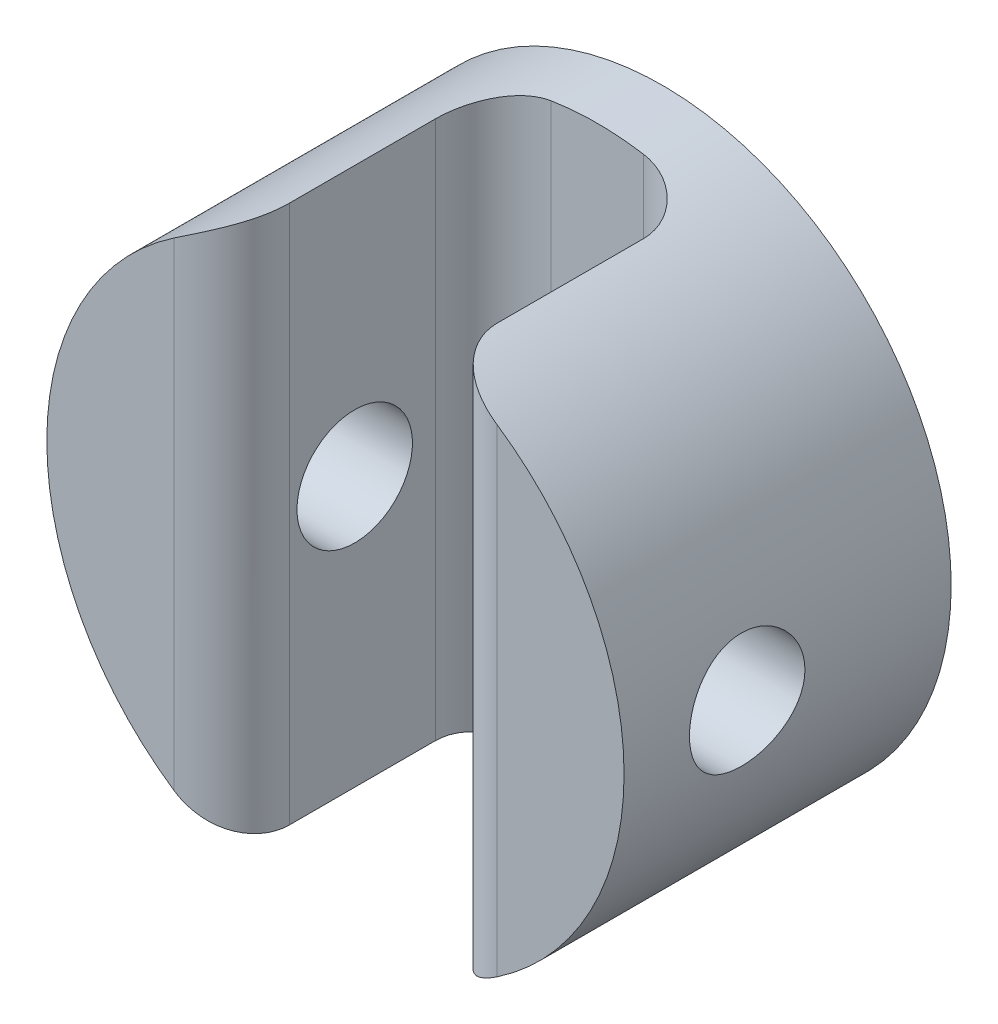
ISO-10303-21;
HEADER;
FILE_DESCRIPTION(('STEP AP214'),'2;1');
FILE_NAME('part.step','',(''),(''),'','','');
FILE_SCHEMA(('AUTOMOTIVE_DESIGN { 1 0 10303 214 1 1 1 1 }'));
ENDSEC;
DATA;
#1=APPLICATION_CONTEXT('core data for automotive mechanical design processes');
#2=APPLICATION_PROTOCOL_DEFINITION('international standard','automotive_design',2000,#1);
#3=PRODUCT_CONTEXT('',#1,'mechanical');
#4=PRODUCT('Part','Part','',(#3));
#5=PRODUCT_RELATED_PRODUCT_CATEGORY('part','',(#4));
#6=PRODUCT_DEFINITION_FORMATION('','',#4);
#7=PRODUCT_DEFINITION_CONTEXT('part definition',#1,'design');
#8=PRODUCT_DEFINITION('design','',#6,#7);
#9=PRODUCT_DEFINITION_SHAPE('','',#8);
#10=(LENGTH_UNIT() NAMED_UNIT(*) SI_UNIT(.MILLI.,.METRE.));
#11=(NAMED_UNIT(*) PLANE_ANGLE_UNIT() SI_UNIT($,.RADIAN.));
#12=(NAMED_UNIT(*) SI_UNIT($,.STERADIAN.) SOLID_ANGLE_UNIT());
#13=UNCERTAINTY_MEASURE_WITH_UNIT(LENGTH_MEASURE(1.E-05),#10,'distance_accuracy_value','');
#14=(GEOMETRIC_REPRESENTATION_CONTEXT(3) GLOBAL_UNCERTAINTY_ASSIGNED_CONTEXT((#13)) GLOBAL_UNIT_ASSIGNED_CONTEXT((#10,
#11,#12)) REPRESENTATION_CONTEXT('',''));
#15=CARTESIAN_POINT('',(0.,0.,0.));
#16=DIRECTION('',(0.,0.,1.));
#17=DIRECTION('',(1.,0.,0.));
#18=AXIS2_PLACEMENT_3D('',#15,#16,#17);
#19=CARTESIAN_POINT('',(0.,0.,8.5));
#20=DIRECTION('',(0.,0.,-1.));
#21=DIRECTION('',(-1.,0.,0.));
#22=AXIS2_PLACEMENT_3D('',#19,#20,#21);
#23=CYLINDRICAL_SURFACE('',#22,7.5);
#24=DIRECTION('',(0.,0.,-1.));
#25=VECTOR('',#24,1.);
#26=CARTESIAN_POINT('',(2.7,6.99714227381436,8.5));
#27=LINE('',#26,#25);
#28=CARTESIAN_POINT('',(2.7,6.99714227381436,3.2));
#29=VERTEX_POINT('',#28);
#30=CARTESIAN_POINT('',(2.7,6.99714227381436,7.));
#31=VERTEX_POINT('',#30);
#32=EDGE_CURVE('E104',#29,#31,#27,.F.);
#33=ORIENTED_EDGE('',*,*,#32,.T.);
#34=CARTESIAN_POINT('',(2.7,6.99714227381436,7.));
#35=CARTESIAN_POINT('',(2.69999901075075,6.99714064902579,7.03979783044758));
#36=CARTESIAN_POINT('',(2.70158501028902,6.99653088167752,7.07957622742591));
#37=CARTESIAN_POINT('',(2.70790371255194,6.99408853853974,7.15884000730107));
#38=CARTESIAN_POINT('',(2.7126360600533,6.99225610078986,7.19832542276677));
#39=CARTESIAN_POINT('',(2.73147700896505,6.9849285050591,7.31575484248));
#40=CARTESIAN_POINT('',(2.75022986375471,6.97760311004875,7.39289777237514));
#41=CARTESIAN_POINT('',(2.79938504908578,6.95802656053791,7.54267951383766));
#42=CARTESIAN_POINT('',(2.82978945530377,6.94577452835782,7.61531752019087));
#43=CARTESIAN_POINT('',(2.90104362961861,6.91631593994004,7.75418895254782));
#44=CARTESIAN_POINT('',(2.94189468728855,6.89910877198907,7.82042158645669));
#45=CARTESIAN_POINT('',(3.0331811240924,6.85946925692275,7.94585818579454));
#46=CARTESIAN_POINT('',(3.08375912976139,6.83695786148238,8.00493302945643));
#47=CARTESIAN_POINT('',(3.19212325955173,6.78703935801539,8.11358635338742));
#48=CARTESIAN_POINT('',(3.24990874943115,6.75963268067067,8.16316566826891));
#49=CARTESIAN_POINT('',(3.37412890684956,6.69852984317404,8.25467962144271));
#50=CARTESIAN_POINT('',(3.44086858461857,6.66456460641318,8.29601902238436));
#51=CARTESIAN_POINT('',(3.57797285348157,6.59197585145777,8.36713720085007));
#52=CARTESIAN_POINT('',(3.64834307662291,6.55334496291006,8.39689736512886));
#53=CARTESIAN_POINT('',(3.79928593747917,6.46713564934164,8.4479349962014));
#54=CARTESIAN_POINT('',(3.88006131293424,6.4190402548443,8.46774698073349));
#55=CARTESIAN_POINT('',(4.00074847013445,6.34399458254306,8.48726593628329));
#56=CARTESIAN_POINT('',(4.04084938347569,6.31852855187642,8.49207274598602));
#57=CARTESIAN_POINT('',(4.12071544362077,6.26673503591208,8.4984370225042));
#58=CARTESIAN_POINT('',(4.1604807961839,6.24040813540344,8.49999665039759));
#59=CARTESIAN_POINT('',(4.2,6.2136945531624,8.5));
#60=B_SPLINE_CURVE_WITH_KNOTS('',3,(#34,#35,#36,#37,#38,#39,#40,#41,#42,#43,#44,#45,#46,#47,#48,
#49,#50,#51,#52,#53,#54,#55,#56,#57,#58,#59),.UNSPECIFIED.,.F.,.F.,(4,2,2,2,2,2,2,2,2,2,2,2,4),
(0.,0.119318807319627,0.238624145810228,0.476566349535827,0.71455096141897,0.952564965191399,
1.1943795814936,1.43617293366244,1.69171953690056,1.94767524240694,2.23465635336297,
2.37779672895484,2.52084181067769),.UNSPECIFIED.);
#61=CARTESIAN_POINT('',(4.2,6.21369455316239,8.5));
#62=VERTEX_POINT('',#61);
#63=EDGE_CURVE('E176',#31,#62,#60,.T.);
#64=ORIENTED_EDGE('',*,*,#63,.T.);
#65=CARTESIAN_POINT('',(0.,0.,8.5));
#66=DIRECTION('',(0.,0.,1.));
#67=DIRECTION('',(1.,0.,0.));
#68=AXIS2_PLACEMENT_3D('',#65,#66,#67);
#69=CIRCLE('',#68,7.5);
#70=CARTESIAN_POINT('',(4.2,-6.21369455316239,8.5));
#71=VERTEX_POINT('',#70);
#72=EDGE_CURVE('E222',#71,#62,#69,.T.);
#73=ORIENTED_EDGE('',*,*,#72,.F.);
#74=CARTESIAN_POINT('',(4.2,-6.21369455316239,8.5));
#75=CARTESIAN_POINT('',(4.15611963408237,-6.24335706880683,8.49999551095912));
#76=CARTESIAN_POINT('',(4.11193392579509,-6.27254245859217,8.4980727699554));
#77=CARTESIAN_POINT('',(4.02317639226095,-6.32983747982932,8.49020992562932));
#78=CARTESIAN_POINT('',(3.97860428665225,-6.35794623289555,8.48426661286554));
#79=CARTESIAN_POINT('',(3.8442433054268,-6.44071822127688,8.46004678259562));
#80=CARTESIAN_POINT('',(3.75431648891797,-6.49348526769673,8.43537605340667));
#81=CARTESIAN_POINT('',(3.57714735550396,-6.59275324153459,8.36787754574778));
#82=CARTESIAN_POINT('',(3.48992121011476,-6.63922057200203,8.32495710494464));
#83=CARTESIAN_POINT('',(3.3230854103763,-6.72427226897459,8.22091254925804));
#84=CARTESIAN_POINT('',(3.24345115619362,-6.76288259028807,8.15985006531398));
#85=CARTESIAN_POINT('',(3.10615205089179,-6.82691681893976,8.03013961304627));
#86=CARTESIAN_POINT('',(3.04697280758879,-6.85341641231361,7.96362155036336));
#87=CARTESIAN_POINT('',(2.94049438580119,-6.89977364043884,7.81954570161062));
#88=CARTESIAN_POINT('',(2.89319851472378,-6.91962942657961,7.74198485147632));
#89=CARTESIAN_POINT('',(2.81708282160569,-6.95094029241974,7.58673420113851));
#90=CARTESIAN_POINT('',(2.78688022943815,-6.9630408785615,7.5098471274198));
#91=CARTESIAN_POINT('',(2.73946636114235,-6.98183249196476,7.35161451985347));
#92=CARTESIAN_POINT('',(2.72223154655002,-6.98853332217217,7.27027735299172));
#93=CARTESIAN_POINT('',(2.7078915799878,-6.99409280425032,7.15686890115941));
#94=CARTESIAN_POINT('',(2.70493192347099,-6.99523749777896,7.12555272553583));
#95=CARTESIAN_POINT('',(2.70098855793507,-6.99676106467131,7.06282946262944));
#96=CARTESIAN_POINT('',(2.70000160024017,-6.99714119713438,7.03142261025558));
#97=CARTESIAN_POINT('',(2.7,-6.99714227381436,7.));
#98=B_SPLINE_CURVE_WITH_KNOTS('',3,(#74,#75,#76,#77,#78,#79,#80,#81,#82,#83,#84,#85,#86,#87,#88,
#89,#90,#91,#92,#93,#94,#95,#96,#97),.UNSPECIFIED.,.F.,.F.,(4,2,2,2,2,2,2,2,2,2,2,4),(0.,
0.15882283075244,0.317772592455626,0.637484702239438,0.958839898167589,1.27911565274865,
1.55624736253,1.833456119011,2.08269305146702,2.33147648276226,2.42585064936943,
2.52006927043205),.UNSPECIFIED.);
#99=CARTESIAN_POINT('',(2.7,-6.99714227381436,7.));
#100=VERTEX_POINT('',#99);
#101=EDGE_CURVE('E170',#71,#100,#98,.T.);
#102=ORIENTED_EDGE('',*,*,#101,.T.);
#103=DIRECTION('',(0.,0.,-1.));
#104=VECTOR('',#103,1.);
#105=CARTESIAN_POINT('',(2.7,-6.99714227381436,8.5));
#106=LINE('',#105,#104);
#107=CARTESIAN_POINT('',(2.7,-6.99714227381436,3.2));
#108=VERTEX_POINT('',#107);
#109=EDGE_CURVE('E123',#100,#108,#106,.T.);
#110=ORIENTED_EDGE('',*,*,#109,.T.);
#111=CARTESIAN_POINT('',(2.7,-6.99714227381436,3.2));
#112=CARTESIAN_POINT('',(2.70000125296468,-6.99713962337673,3.15951193135814));
#113=CARTESIAN_POINT('',(2.69835961966364,-6.99777547046994,3.11904445299375));
#114=CARTESIAN_POINT('',(2.69182061132891,-7.00029429228222,3.03842269166137));
#115=CARTESIAN_POINT('',(2.68692406854953,-7.0021769482018,2.99826833128626));
#116=CARTESIAN_POINT('',(2.6674473057059,-7.00963114859332,2.87896692587078));
#117=CARTESIAN_POINT('',(2.64807939215009,-7.01700941231577,2.80065734306411));
#118=CARTESIAN_POINT('',(2.59731346685796,-7.03595660080242,2.64869052961801));
#119=CARTESIAN_POINT('',(2.56592139674573,-7.04752345565975,2.57503102209406));
#120=CARTESIAN_POINT('',(2.49214676702811,-7.07394765910813,2.43404351707832));
#121=CARTESIAN_POINT('',(2.44975788542509,-7.08880689975164,2.36671919208228));
#122=CARTESIAN_POINT('',(2.35348293661988,-7.12136130631972,2.23760765402669));
#123=CARTESIAN_POINT('',(2.29923237903798,-7.1391404613452,2.17611387785227));
#124=CARTESIAN_POINT('',(2.18167724451883,-7.17593721762506,2.06291061543522));
#125=CARTESIAN_POINT('',(2.11836942746737,-7.19495526074335,2.01120464609467));
#126=CARTESIAN_POINT('',(1.9807167592102,-7.23409546746183,1.91632205529297));
#127=CARTESIAN_POINT('',(1.90596781240558,-7.25422335189708,1.87373302516663));
#128=CARTESIAN_POINT('',(1.75008819624826,-7.29339688274251,1.80187285626729));
#129=CARTESIAN_POINT('',(1.6689614673731,-7.31244318506541,1.77259356882458));
#130=CARTESIAN_POINT('',(1.52314676077358,-7.34398524656892,1.73378947900306));
#131=CARTESIAN_POINT('',(1.45936512565716,-7.35693490282287,1.72116778239895));
#132=CARTESIAN_POINT('',(1.33045185722167,-7.38134590470554,1.70426624660359));
#133=CARTESIAN_POINT('',(1.26532067117927,-7.39280773457138,1.69998368691991));
#134=CARTESIAN_POINT('',(1.2,-7.40337760755184,1.7));
#135=B_SPLINE_CURVE_WITH_KNOTS('',3,(#111,#112,#113,#114,#115,#116,#117,#118,#119,#120,#121,
#122,#123,#124,#125,#126,#127,#128,#129,#130,#131,#132,#133,#134),.UNSPECIFIED.,.F.,.F.,(4,2,2,
2,2,2,2,2,2,2,2,4),(0.,0.121385706498105,0.242740387574913,0.484490084742728,0.726120477356751,
0.967890090784091,1.21852218084326,1.46924415644351,1.73308025163878,1.99675459927851,
2.19510940384687,2.39339948790345),.UNSPECIFIED.);
#136=CARTESIAN_POINT('',(1.2,-7.40337760755184,1.7));
#137=VERTEX_POINT('',#136);
#138=EDGE_CURVE('E111',#108,#137,#135,.T.);
#139=ORIENTED_EDGE('',*,*,#138,.T.);
#140=CARTESIAN_POINT('',(0.,0.,1.7));
#141=DIRECTION('',(0.,0.,-1.));
#142=DIRECTION('',(-1.,0.,0.));
#143=AXIS2_PLACEMENT_3D('',#140,#141,#142);
#144=CIRCLE('',#143,7.5);
#145=CARTESIAN_POINT('',(-1.2,-7.40337760755184,1.7));
#146=VERTEX_POINT('',#145);
#147=EDGE_CURVE('E131',#137,#146,#144,.T.);
#148=ORIENTED_EDGE('',*,*,#147,.T.);
#149=CARTESIAN_POINT('',(-1.2,-7.40337760755184,1.7));
#150=CARTESIAN_POINT('',(-1.24300927927867,-7.39640849561792,1.7000000568597));
#151=CARTESIAN_POINT('',(-1.28593375830723,-7.38906367404699,1.70185074555048));
#152=CARTESIAN_POINT('',(-1.37133566686447,-7.37369078453554,1.70920087043045));
#153=CARTESIAN_POINT('',(-1.41381319955502,-7.36566287832897,1.71469944499383));
#154=CARTESIAN_POINT('',(-1.53996823675266,-7.34069538736141,1.73655119518603));
#155=CARTESIAN_POINT('',(-1.62259723576248,-7.32283466137035,1.75826099514155));
#156=CARTESIAN_POINT('',(-1.78259670298157,-7.28554150519219,1.81515358479985));
#157=CARTESIAN_POINT('',(-1.85996925647975,-7.266109705047,1.85033099457077));
#158=CARTESIAN_POINT('',(-2.00762254649971,-7.2267069178112,1.93314950421742));
#159=CARTESIAN_POINT('',(-2.07790072689887,-7.20673573964301,1.98079507435218));
#160=CARTESIAN_POINT('',(-2.2109008172675,-7.16706624816437,2.08844715239278));
#161=CARTESIAN_POINT('',(-2.27343819870841,-7.14738193094582,2.14868712678051));
#162=CARTESIAN_POINT('',(-2.38747029866222,-7.11010494419513,2.27943742940958));
#163=CARTESIAN_POINT('',(-2.43896405509274,-7.09251245695541,2.34994865154868));
#164=CARTESIAN_POINT('',(-2.52856466520879,-7.06106160193352,2.49834332811706));
#165=CARTESIAN_POINT('',(-2.56685381662891,-7.04715305547881,2.57610583995719));
#166=CARTESIAN_POINT('',(-2.62957781524466,-7.0239911146211,2.73762983180682));
#167=CARTESIAN_POINT('',(-2.65403243666527,-7.01473107806937,2.82138255577644));
#168=CARTESIAN_POINT('',(-2.68066454324547,-7.00457983188053,2.95493712439231));
#169=CARTESIAN_POINT('',(-2.6879056220673,-7.00180026814942,3.00364119345118));
#170=CARTESIAN_POINT('',(-2.69757421982452,-6.99807854917595,3.10155359660865));
#171=CARTESIAN_POINT('',(-2.70000563709297,-6.99713490589123,3.15076148979982));
#172=CARTESIAN_POINT('',(-2.7,-6.99714227381436,3.2));
#173=B_SPLINE_CURVE_WITH_KNOTS('',3,(#149,#150,#151,#152,#153,#154,#155,#156,#157,#158,#159,
#160,#161,#162,#163,#164,#165,#166,#167,#168,#169,#170,#171,#172),.UNSPECIFIED.,.F.,.F.,(4,2,2,
2,2,2,2,2,2,2,2,4),(0.,0.130624585449255,0.261218328523449,0.521718653856982,0.782115025025229,
1.04260488535717,1.30843704825689,1.57429236013547,1.83631479735607,2.0979617634134,
2.24566938673828,2.39325724075668),.UNSPECIFIED.);
#174=CARTESIAN_POINT('',(-2.7,-6.99714227381436,3.2));
#175=VERTEX_POINT('',#174);
#176=EDGE_CURVE('E45',#146,#175,#173,.T.);
#177=ORIENTED_EDGE('',*,*,#176,.T.);
#178=DIRECTION('',(0.,0.,-1.));
#179=VECTOR('',#178,1.);
#180=CARTESIAN_POINT('',(-2.7,-6.99714227381436,8.5));
#181=LINE('',#180,#179);
#182=CARTESIAN_POINT('',(-2.7,-6.99714227381436,7.));
#183=VERTEX_POINT('',#182);
#184=EDGE_CURVE('E219',#175,#183,#181,.F.);
#185=ORIENTED_EDGE('',*,*,#184,.T.);
#186=CARTESIAN_POINT('',(-2.7,-6.99714227381436,7.));
#187=CARTESIAN_POINT('',(-2.69999901075075,-6.99714064902579,7.03979783044758));
#188=CARTESIAN_POINT('',(-2.70158501028902,-6.99653088167752,7.07957622742591));
#189=CARTESIAN_POINT('',(-2.70790371255194,-6.99408853853974,7.15884000730107));
#190=CARTESIAN_POINT('',(-2.7126360600533,-6.99225610078986,7.19832542276677));
#191=CARTESIAN_POINT('',(-2.73147700896505,-6.9849285050591,7.31575484248));
#192=CARTESIAN_POINT('',(-2.75022986375471,-6.97760311004875,7.39289777237514));
#193=CARTESIAN_POINT('',(-2.79938504908578,-6.95802656053791,7.54267951383766));
#194=CARTESIAN_POINT('',(-2.82978945530377,-6.94577452835782,7.61531752019087));
#195=CARTESIAN_POINT('',(-2.90104362961861,-6.91631593994004,7.75418895254782));
#196=CARTESIAN_POINT('',(-2.94189468728855,-6.89910877198907,7.82042158645669));
#197=CARTESIAN_POINT('',(-3.0331811240924,-6.85946925692275,7.94585818579454));
#198=CARTESIAN_POINT('',(-3.08375912976139,-6.83695786148238,8.00493302945643));
#199=CARTESIAN_POINT('',(-3.19212325955173,-6.78703935801539,8.11358635338742));
#200=CARTESIAN_POINT('',(-3.24990874943115,-6.75963268067067,8.16316566826891));
#201=CARTESIAN_POINT('',(-3.37412890684956,-6.69852984317404,8.25467962144271));
#202=CARTESIAN_POINT('',(-3.44086858461857,-6.66456460641318,8.29601902238436));
#203=CARTESIAN_POINT('',(-3.57797285348157,-6.59197585145777,8.36713720085007));
#204=CARTESIAN_POINT('',(-3.64834307662291,-6.55334496291006,8.39689736512886));
#205=CARTESIAN_POINT('',(-3.79928593747917,-6.46713564934164,8.4479349962014));
#206=CARTESIAN_POINT('',(-3.88006131293424,-6.4190402548443,8.46774698073349));
#207=CARTESIAN_POINT('',(-4.00074847013445,-6.34399458254306,8.48726593628329));
#208=CARTESIAN_POINT('',(-4.04084938347569,-6.31852855187643,8.49207274598602));
#209=CARTESIAN_POINT('',(-4.12071544362077,-6.26673503591208,8.4984370225042));
#210=CARTESIAN_POINT('',(-4.1604807961839,-6.24040813540344,8.49999665039759));
#211=CARTESIAN_POINT('',(-4.2,-6.2136945531624,8.5));
#212=B_SPLINE_CURVE_WITH_KNOTS('',3,(#186,#187,#188,#189,#190,#191,#192,#193,#194,#195,#196,
#197,#198,#199,#200,#201,#202,#203,#204,#205,#206,#207,#208,#209,#210,#211),.UNSPECIFIED.,.F.,
.F.,(4,2,2,2,2,2,2,2,2,2,2,2,4),(0.,0.119318807319627,0.238624145810228,0.476566349535827,
0.714550961418972,0.952564965191399,1.1943795814936,1.43617293366244,1.69171953690056,
1.94767524240693,2.23465635336297,2.37779672895484,2.52084181067768),.UNSPECIFIED.);
#213=CARTESIAN_POINT('',(-4.2,-6.21369455316239,8.5));
#214=VERTEX_POINT('',#213);
#215=EDGE_CURVE('E52',#183,#214,#212,.T.);
#216=ORIENTED_EDGE('',*,*,#215,.T.);
#217=CARTESIAN_POINT('',(-4.2,6.21369455316239,8.5));
#218=VERTEX_POINT('',#217);
#219=EDGE_CURVE('E217',#218,#214,#69,.T.);
#220=ORIENTED_EDGE('',*,*,#219,.F.);
#221=CARTESIAN_POINT('',(-4.2,6.21369455316239,8.5));
#222=CARTESIAN_POINT('',(-4.15611963408237,6.24335706880683,8.49999551095912));
#223=CARTESIAN_POINT('',(-4.11193392579509,6.27254245859217,8.4980727699554));
#224=CARTESIAN_POINT('',(-4.02317639226095,6.32983747982932,8.49020992562932));
#225=CARTESIAN_POINT('',(-3.97860428665225,6.35794623289555,8.48426661286554));
#226=CARTESIAN_POINT('',(-3.8442433054268,6.44071822127688,8.46004678259562));
#227=CARTESIAN_POINT('',(-3.75431648891797,6.49348526769673,8.43537605340667));
#228=CARTESIAN_POINT('',(-3.57714735550396,6.59275324153459,8.36787754574778));
#229=CARTESIAN_POINT('',(-3.48992121011476,6.63922057200203,8.32495710494464));
#230=CARTESIAN_POINT('',(-3.3230854103763,6.72427226897459,8.22091254925804));
#231=CARTESIAN_POINT('',(-3.24345115619362,6.76288259028807,8.15985006531398));
#232=CARTESIAN_POINT('',(-3.10615205089179,6.82691681893976,8.03013961304627));
#233=CARTESIAN_POINT('',(-3.04697280758879,6.85341641231361,7.96362155036336));
#234=CARTESIAN_POINT('',(-2.94049438580119,6.89977364043884,7.81954570161062));
#235=CARTESIAN_POINT('',(-2.89319851472378,6.91962942657961,7.74198485147632));
#236=CARTESIAN_POINT('',(-2.81708282160569,6.95094029241974,7.58673420113851));
#237=CARTESIAN_POINT('',(-2.78688022943815,6.96304087856151,7.5098471274198));
#238=CARTESIAN_POINT('',(-2.73946636114234,6.98183249196477,7.35161451985347));
#239=CARTESIAN_POINT('',(-2.72223154655002,6.98853332217217,7.27027735299172));
#240=CARTESIAN_POINT('',(-2.7078915799878,6.99409280425032,7.15686890115941));
#241=CARTESIAN_POINT('',(-2.70493192347099,6.99523749777896,7.12555272553582));
#242=CARTESIAN_POINT('',(-2.70098855793507,6.99676106467131,7.06282946262944));
#243=CARTESIAN_POINT('',(-2.70000160024017,6.99714119713438,7.03142261025558));
#244=CARTESIAN_POINT('',(-2.7,6.99714227381436,7.));
#245=B_SPLINE_CURVE_WITH_KNOTS('',3,(#221,#222,#223,#224,#225,#226,#227,#228,#229,#230,#231,
#232,#233,#234,#235,#236,#237,#238,#239,#240,#241,#242,#243,#244),.UNSPECIFIED.,.F.,.F.,(4,2,2,
2,2,2,2,2,2,2,2,4),(0.,0.15882283075244,0.317772592455626,0.637484702239438,0.958839898167589,
1.27911565274865,1.55624736253,1.833456119011,2.08269305146702,2.33147648276226,
2.42585064936943,2.52006927043205),.UNSPECIFIED.);
#246=CARTESIAN_POINT('',(-2.7,6.99714227381436,7.));
#247=VERTEX_POINT('',#246);
#248=EDGE_CURVE('E129',#218,#247,#245,.T.);
#249=ORIENTED_EDGE('',*,*,#248,.T.);
#250=DIRECTION('',(0.,0.,-1.));
#251=VECTOR('',#250,1.);
#252=CARTESIAN_POINT('',(-2.7,6.99714227381436,8.5));
#253=LINE('',#252,#251);
#254=CARTESIAN_POINT('',(-2.7,6.99714227381436,3.2));
#255=VERTEX_POINT('',#254);
#256=EDGE_CURVE('E238',#247,#255,#253,.T.);
#257=ORIENTED_EDGE('',*,*,#256,.T.);
#258=CARTESIAN_POINT('',(-2.7,6.99714227381436,3.2));
#259=CARTESIAN_POINT('',(-2.70000125296468,6.99713962337673,3.15951193135814));
#260=CARTESIAN_POINT('',(-2.69835961966364,6.99777547046994,3.11904445299375));
#261=CARTESIAN_POINT('',(-2.69182061132891,7.00029429228222,3.03842269166137));
#262=CARTESIAN_POINT('',(-2.68692406854953,7.0021769482018,2.99826833128626));
#263=CARTESIAN_POINT('',(-2.6674473057059,7.00963114859332,2.87896692587078));
#264=CARTESIAN_POINT('',(-2.64807939215009,7.01700941231577,2.80065734306411));
#265=CARTESIAN_POINT('',(-2.59731346685796,7.03595660080242,2.64869052961801));
#266=CARTESIAN_POINT('',(-2.56592139674573,7.04752345565975,2.57503102209406));
#267=CARTESIAN_POINT('',(-2.49214676702811,7.07394765910813,2.43404351707832));
#268=CARTESIAN_POINT('',(-2.44975788542509,7.08880689975164,2.36671919208229));
#269=CARTESIAN_POINT('',(-2.35348293661988,7.12136130631972,2.23760765402669));
#270=CARTESIAN_POINT('',(-2.29923237903798,7.1391404613452,2.17611387785227));
#271=CARTESIAN_POINT('',(-2.18167724451883,7.17593721762506,2.06291061543522));
#272=CARTESIAN_POINT('',(-2.11836942746737,7.19495526074335,2.01120464609467));
#273=CARTESIAN_POINT('',(-1.9807167592102,7.23409546746183,1.91632205529297));
#274=CARTESIAN_POINT('',(-1.90596781240558,7.25422335189708,1.87373302516663));
#275=CARTESIAN_POINT('',(-1.75008819624826,7.29339688274251,1.80187285626729));
#276=CARTESIAN_POINT('',(-1.6689614673731,7.31244318506541,1.77259356882458));
#277=CARTESIAN_POINT('',(-1.52314676077358,7.34398524656892,1.73378947900306));
#278=CARTESIAN_POINT('',(-1.45936512565716,7.35693490282287,1.72116778239895));
#279=CARTESIAN_POINT('',(-1.33045185722167,7.38134590470554,1.70426624660359));
#280=CARTESIAN_POINT('',(-1.26532067117927,7.39280773457138,1.69998368691991));
#281=CARTESIAN_POINT('',(-1.2,7.40337760755184,1.7));
#282=B_SPLINE_CURVE_WITH_KNOTS('',3,(#258,#259,#260,#261,#262,#263,#264,#265,#266,#267,#268,
#269,#270,#271,#272,#273,#274,#275,#276,#277,#278,#279,#280,#281),.UNSPECIFIED.,.F.,.F.,(4,2,2,
2,2,2,2,2,2,2,2,4),(0.,0.121385706498105,0.242740387574913,0.484490084742728,0.72612047735675,
0.967890090784091,1.21852218084326,1.46924415644351,1.73308025163878,1.99675459927851,
2.19510940384687,2.39339948790345),.UNSPECIFIED.);
#283=CARTESIAN_POINT('',(-1.2,7.40337760755184,1.7));
#284=VERTEX_POINT('',#283);
#285=EDGE_CURVE('E11',#255,#284,#282,.T.);
#286=ORIENTED_EDGE('',*,*,#285,.T.);
#287=CARTESIAN_POINT('',(1.2,7.40337760755184,1.7));
#288=VERTEX_POINT('',#287);
#289=EDGE_CURVE('E106',#284,#288,#144,.T.);
#290=ORIENTED_EDGE('',*,*,#289,.T.);
#291=CARTESIAN_POINT('',(1.2,7.40337760755184,1.7));
#292=CARTESIAN_POINT('',(1.24300927927867,7.39640849561792,1.7000000568597));
#293=CARTESIAN_POINT('',(1.28593375830723,7.38906367404699,1.70185074555048));
#294=CARTESIAN_POINT('',(1.37133566686447,7.37369078453555,1.70920087043045));
#295=CARTESIAN_POINT('',(1.41381319955502,7.36566287832897,1.71469944499383));
#296=CARTESIAN_POINT('',(1.53996823675266,7.34069538736141,1.73655119518603));
#297=CARTESIAN_POINT('',(1.62259723576248,7.32283466137035,1.75826099514155));
#298=CARTESIAN_POINT('',(1.78259670298157,7.28554150519219,1.81515358479985));
#299=CARTESIAN_POINT('',(1.85996925647975,7.266109705047,1.85033099457077));
#300=CARTESIAN_POINT('',(2.00762254649971,7.2267069178112,1.93314950421742));
#301=CARTESIAN_POINT('',(2.07790072689887,7.20673573964301,1.98079507435218));
#302=CARTESIAN_POINT('',(2.21090081726749,7.16706624816437,2.08844715239278));
#303=CARTESIAN_POINT('',(2.27343819870841,7.14738193094582,2.14868712678051));
#304=CARTESIAN_POINT('',(2.38747029866222,7.11010494419513,2.27943742940958));
#305=CARTESIAN_POINT('',(2.43896405509274,7.09251245695541,2.34994865154868));
#306=CARTESIAN_POINT('',(2.52856466520879,7.06106160193352,2.49834332811706));
#307=CARTESIAN_POINT('',(2.56685381662891,7.04715305547881,2.57610583995719));
#308=CARTESIAN_POINT('',(2.62957781524466,7.0239911146211,2.73762983180682));
#309=CARTESIAN_POINT('',(2.65403243666527,7.01473107806937,2.82138255577644));
#310=CARTESIAN_POINT('',(2.68066454324547,7.00457983188053,2.95493712439231));
#311=CARTESIAN_POINT('',(2.6879056220673,7.00180026814942,3.00364119345117));
#312=CARTESIAN_POINT('',(2.69757421982452,6.99807854917595,3.10155359660865));
#313=CARTESIAN_POINT('',(2.70000563709297,6.99713490589123,3.15076148979982));
#314=CARTESIAN_POINT('',(2.7,6.99714227381436,3.2));
#315=B_SPLINE_CURVE_WITH_KNOTS('',3,(#291,#292,#293,#294,#295,#296,#297,#298,#299,#300,#301,
#302,#303,#304,#305,#306,#307,#308,#309,#310,#311,#312,#313,#314),.UNSPECIFIED.,.F.,.F.,(4,2,2,
2,2,2,2,2,2,2,2,4),(0.,0.130624585449255,0.261218328523449,0.521718653856982,0.782115025025229,
1.04260488535717,1.30843704825689,1.57429236013547,1.83631479735607,2.0979617634134,
2.24566938673827,2.39325724075668),.UNSPECIFIED.);
#316=EDGE_CURVE('E101',#288,#29,#315,.T.);
#317=ORIENTED_EDGE('',*,*,#316,.T.);
#318=EDGE_LOOP('',(#33,#64,#73,#102,#110,#139,#148,#177,#185,#216,#220,#249,#257,#286,#290,#317));
#319=FACE_BOUND('',#318,.T.);
#320=CARTESIAN_POINT('',(0.,0.,0.));
#321=DIRECTION('',(0.,0.,1.));
#322=DIRECTION('',(1.,0.,0.));
#323=AXIS2_PLACEMENT_3D('',#320,#321,#322);
#324=CIRCLE('',#323,7.5);
#325=CARTESIAN_POINT('',(7.5,0.,0.));
#326=VERTEX_POINT('',#325);
#327=EDGE_CURVE('E236',#326,#326,#324,.T.);
#328=ORIENTED_EDGE('',*,*,#327,.T.);
#329=EDGE_LOOP('',(#328));
#330=FACE_BOUND('',#329,.T.);
#331=CARTESIAN_POINT('',(-7.5,0.,6.8));
#332=CARTESIAN_POINT('',(-7.49999846371306,0.0833653601889499,6.79999693325248));
#333=CARTESIAN_POINT('',(-7.49859577767346,0.166769490302284,6.79302673554853));
#334=CARTESIAN_POINT('',(-7.49313548434847,0.331220261533529,6.76535224982713));
#335=CARTESIAN_POINT('',(-7.48907576790279,0.412264976312034,6.74463705079774));
#336=CARTESIAN_POINT('',(-7.4787547391743,0.569595457894969,6.69013808956882));
#337=CARTESIAN_POINT('',(-7.47249553615077,0.645885701899701,6.65636684473297));
#338=CARTESIAN_POINT('',(-7.45845597052971,0.791711983296338,6.57675162873306));
#339=CARTESIAN_POINT('',(-7.4506756985356,0.861248422613718,6.53090837658919));
#340=CARTESIAN_POINT('',(-7.43433247994955,0.992540215972298,6.42779225856285));
#341=CARTESIAN_POINT('',(-7.42576118256521,1.05419092673779,6.3703874669132));
#342=CARTESIAN_POINT('',(-7.40886270678882,1.16705513491204,6.24606137541245));
#343=CARTESIAN_POINT('',(-7.40053554750636,1.21826781715564,6.17913933299732));
#344=CARTESIAN_POINT('',(-7.38498662718923,1.30924763002143,6.03692571048219));
#345=CARTESIAN_POINT('',(-7.37777561047419,1.3489064082988,5.96156353430546));
#346=CARTESIAN_POINT('',(-7.36539402087627,1.41495849987046,5.80507727149388));
#347=CARTESIAN_POINT('',(-7.36022324642942,1.44135312365586,5.72395375498049));
#348=CARTESIAN_POINT('',(-7.35259207878307,1.47978794982724,5.55937345413813));
#349=CARTESIAN_POINT('',(-7.35009705160781,1.49201174693817,5.47596118378666));
#350=CARTESIAN_POINT('',(-7.34799562590941,1.50232819158918,5.30823526795349));
#351=CARTESIAN_POINT('',(-7.34838893201761,1.50042228407025,5.22392171551978));
#352=CARTESIAN_POINT('',(-7.35198826722277,1.48268185965273,5.0581298179685));
#353=CARTESIAN_POINT('',(-7.35515179288145,1.46705781036586,4.97662789155903));
#354=CARTESIAN_POINT('',(-7.36386819240002,1.42265682693458,4.8174258850055));
#355=CARTESIAN_POINT('',(-7.36942118036668,1.39387926465102,4.73972598662149));
#356=CARTESIAN_POINT('',(-7.38233427750612,1.32378717551208,4.5897271074446));
#357=CARTESIAN_POINT('',(-7.38970634720557,1.28238922684817,4.51746818064624));
#358=CARTESIAN_POINT('',(-7.40541928159593,1.18829036185902,4.38084372504078));
#359=CARTESIAN_POINT('',(-7.41376025757549,1.13558814653524,4.31647910472326));
#360=CARTESIAN_POINT('',(-7.43065531862193,1.01924990184088,4.1962558963146));
#361=CARTESIAN_POINT('',(-7.43921053816357,0.955434241818668,4.14057114821131));
#362=CARTESIAN_POINT('',(-7.45543273071613,0.819277536093015,4.04066923054816));
#363=CARTESIAN_POINT('',(-7.4630996923346,0.746936381069084,3.99645220805963));
#364=CARTESIAN_POINT('',(-7.47670035241331,0.595589080318381,3.92070873616104));
#365=CARTESIAN_POINT('',(-7.48263133272408,0.51657272937795,3.8892021595332));
#366=CARTESIAN_POINT('',(-7.49207113481787,0.354223464672998,3.83995928894215));
#367=CARTESIAN_POINT('',(-7.49558025000797,0.270891075108675,3.82222132688956));
#368=CARTESIAN_POINT('',(-7.49974007800301,0.103769108440726,3.80126531930858));
#369=CARTESIAN_POINT('',(-7.50043761978705,0.0200104924883646,3.7978093706896));
#370=CARTESIAN_POINT('',(-7.49902577895154,-0.146887401289071,3.80487478841327));
#371=CARTESIAN_POINT('',(-7.49691655412169,-0.23002671366569,3.81539536902889));
#372=CARTESIAN_POINT('',(-7.49015748012026,-0.392558489919811,3.84991756031593));
#373=CARTESIAN_POINT('',(-7.4855306460631,-0.471977922509854,3.87379710274685));
#374=CARTESIAN_POINT('',(-7.47425328091549,-0.625685441249501,3.93422597398371));
#375=CARTESIAN_POINT('',(-7.4676025982134,-0.699973142456309,3.97077625201524));
#376=CARTESIAN_POINT('',(-7.45289867299942,-0.842311760529326,4.05602373597697));
#377=CARTESIAN_POINT('',(-7.44482925655578,-0.910275190128282,4.10486417155842));
#378=CARTESIAN_POINT('',(-7.42822102244824,-1.03712702867881,4.21311378681092));
#379=CARTESIAN_POINT('',(-7.41968215452582,-1.09601446339614,4.2725240995998));
#380=CARTESIAN_POINT('',(-7.40293955335447,-1.20396088616126,4.40131002783669));
#381=CARTESIAN_POINT('',(-7.39474290349956,-1.25285655367298,4.47082361633201));
#382=CARTESIAN_POINT('',(-7.37976287694291,-1.33827813007681,4.61721704203502));
#383=CARTESIAN_POINT('',(-7.37297944370014,-1.37480453388435,4.69409658436033));
#384=CARTESIAN_POINT('',(-7.36165110876574,-1.43422776237294,4.85265236922432));
#385=CARTESIAN_POINT('',(-7.3570946230828,-1.45719524968658,4.93430126181548));
#386=CARTESIAN_POINT('',(-7.35071155188038,-1.48906297744079,5.10040018023636));
#387=CARTESIAN_POINT('',(-7.34888461036667,-1.49796505233767,5.18484983931402));
#388=CARTESIAN_POINT('',(-7.34818724447069,-1.5013813663012,5.35251329681648));
#389=CARTESIAN_POINT('',(-7.34926378783951,-1.49615368210634,5.43572172339051));
#390=CARTESIAN_POINT('',(-7.35413360226921,-1.47202845615009,5.60004747485754));
#391=CARTESIAN_POINT('',(-7.35792685150754,-1.45313102419395,5.68116481654221));
#392=CARTESIAN_POINT('',(-7.36777896328738,-1.40231785274843,5.83884156686082));
#393=CARTESIAN_POINT('',(-7.37383231528246,-1.37043376007602,5.91541154075362));
#394=CARTESIAN_POINT('',(-7.38752572461255,-1.29458196690241,6.06215558110166));
#395=CARTESIAN_POINT('',(-7.39516591498341,-1.25061325316232,6.13232911058771));
#396=CARTESIAN_POINT('',(-7.41133440784838,-1.15095887217962,6.26557335822547));
#397=CARTESIAN_POINT('',(-7.41987559364549,-1.09508683085277,6.32850314790139));
#398=CARTESIAN_POINT('',(-7.43679122807932,-0.973596553519712,6.44417930829376));
#399=CARTESIAN_POINT('',(-7.44516563794777,-0.907976080730003,6.49692333547591));
#400=CARTESIAN_POINT('',(-7.46090748581957,-0.76802644363237,6.59125196591967));
#401=CARTESIAN_POINT('',(-7.46826346828869,-0.693613326644752,6.63271400492004));
#402=CARTESIAN_POINT('',(-7.481026876275,-0.538749541411099,6.70247918389489));
#403=CARTESIAN_POINT('',(-7.48643605707924,-0.45830439129469,6.73079418429874));
#404=CARTESIAN_POINT('',(-7.49364558893056,-0.31473223338567,6.76797792206708));
#405=CARTESIAN_POINT('',(-7.49601454737677,-0.252422496020677,6.77996479056164));
#406=CARTESIAN_POINT('',(-7.49919231209839,-0.126749287815101,6.79597686853755));
#407=CARTESIAN_POINT('',(-7.50000116809732,-0.0633858506229286,6.80000233176465));
#408=CARTESIAN_POINT('',(-7.5,0.,6.8));
#409=B_SPLINE_CURVE_WITH_KNOTS('',3,(#331,#332,#333,#334,#335,#336,#337,#338,#339,#340,#341,
#342,#343,#344,#345,#346,#347,#348,#349,#350,#351,#352,#353,#354,#355,#356,#357,#358,#359,#360,
#361,#362,#363,#364,#365,#366,#367,#368,#369,#370,#371,#372,#373,#374,#375,#376,#377,#378,#379,
#380,#381,#382,#383,#384,#385,#386,#387,#388,#389,#390,#391,#392,#393,#394,#395,#396,#397,#398,
#399,#400,#401,#402,#403,#404,#405,#406,#407,#408),.UNSPECIFIED.,.T.,.F.,(4,2,2,2,2,2,2,2,2,2,2,
2,2,2,2,2,2,2,2,2,2,2,2,2,2,2,2,2,2,2,2,2,2,2,2,2,2,2,4),(0.,0.249864195991888,
0.499926976036985,0.749750602875512,0.999559353346295,1.25239900516828,1.50525839512105,
1.76041792508884,2.01555224047796,2.26734277655381,2.51910756421838,2.76707590509417,
3.01505608880595,3.26471235305389,3.51439732124506,3.76857378737026,4.02275351309731,
4.27732912281036,4.53187388547054,4.78216103514398,5.03243411486801,5.28045680926085,
5.52849808824034,5.77957599050038,6.03068082518895,6.28560942868839,6.540527830852,
6.79410571549085,7.04765052495622,7.29659583851552,7.54553915238913,7.79387941879665,
8.042240513728,8.29482114358715,8.54745981799396,8.80274245013456,9.05779433276278,
9.24778162934841,9.43776287056495),.UNSPECIFIED.);
#410=CARTESIAN_POINT('',(-7.5,0.,6.8));
#411=VERTEX_POINT('',#410);
#412=EDGE_CURVE('E157',#411,#411,#409,.T.);
#413=ORIENTED_EDGE('',*,*,#412,.F.);
#414=EDGE_LOOP('',(#413));
#415=FACE_BOUND('',#414,.T.);
#416=CARTESIAN_POINT('',(7.5,0.,6.8));
#417=CARTESIAN_POINT('',(7.49999846371307,-0.0833653601889499,6.79999693325248));
#418=CARTESIAN_POINT('',(7.49859577767346,-0.166769490302284,6.79302673554853));
#419=CARTESIAN_POINT('',(7.49313548434847,-0.331220261533529,6.76535224982713));
#420=CARTESIAN_POINT('',(7.48907576790279,-0.412264976312034,6.74463705079774));
#421=CARTESIAN_POINT('',(7.4787547391743,-0.56959545789497,6.69013808956882));
#422=CARTESIAN_POINT('',(7.47249553615077,-0.645885701899702,6.65636684473297));
#423=CARTESIAN_POINT('',(7.45845597052971,-0.791711983296339,6.57675162873306));
#424=CARTESIAN_POINT('',(7.4506756985356,-0.861248422613718,6.53090837658919));
#425=CARTESIAN_POINT('',(7.43433247994955,-0.992540215972298,6.42779225856285));
#426=CARTESIAN_POINT('',(7.42576118256521,-1.05419092673779,6.3703874669132));
#427=CARTESIAN_POINT('',(7.40886270678882,-1.16705513491204,6.24606137541245));
#428=CARTESIAN_POINT('',(7.40053554750636,-1.21826781715564,6.17913933299732));
#429=CARTESIAN_POINT('',(7.38498662718923,-1.30924763002143,6.03692571048219));
#430=CARTESIAN_POINT('',(7.37777561047419,-1.3489064082988,5.96156353430546));
#431=CARTESIAN_POINT('',(7.36539402087627,-1.41495849987046,5.80507727149388));
#432=CARTESIAN_POINT('',(7.36022324642942,-1.44135312365586,5.72395375498048));
#433=CARTESIAN_POINT('',(7.35259207878307,-1.47978794982724,5.55937345413813));
#434=CARTESIAN_POINT('',(7.35009705160781,-1.49201174693817,5.47596118378666));
#435=CARTESIAN_POINT('',(7.34799562590941,-1.50232819158918,5.30823526795349));
#436=CARTESIAN_POINT('',(7.34838893201761,-1.50042228407025,5.22392171551978));
#437=CARTESIAN_POINT('',(7.35198826722277,-1.48268185965273,5.0581298179685));
#438=CARTESIAN_POINT('',(7.35515179288145,-1.46705781036586,4.97662789155903));
#439=CARTESIAN_POINT('',(7.36386819240002,-1.42265682693458,4.8174258850055));
#440=CARTESIAN_POINT('',(7.36942118036668,-1.39387926465102,4.73972598662149));
#441=CARTESIAN_POINT('',(7.38233427750612,-1.32378717551208,4.5897271074446));
#442=CARTESIAN_POINT('',(7.38970634720557,-1.28238922684817,4.51746818064624));
#443=CARTESIAN_POINT('',(7.40541928159593,-1.18829036185902,4.38084372504078));
#444=CARTESIAN_POINT('',(7.41376025757549,-1.13558814653524,4.31647910472326));
#445=CARTESIAN_POINT('',(7.43065531862193,-1.01924990184088,4.1962558963146));
#446=CARTESIAN_POINT('',(7.43921053816357,-0.955434241818668,4.14057114821131));
#447=CARTESIAN_POINT('',(7.45543273071613,-0.819277536093015,4.04066923054816));
#448=CARTESIAN_POINT('',(7.4630996923346,-0.746936381069084,3.99645220805963));
#449=CARTESIAN_POINT('',(7.47670035241331,-0.595589080318381,3.92070873616104));
#450=CARTESIAN_POINT('',(7.48263133272408,-0.516572729377951,3.8892021595332));
#451=CARTESIAN_POINT('',(7.49207113481787,-0.354223464672998,3.83995928894215));
#452=CARTESIAN_POINT('',(7.49558025000797,-0.270891075108675,3.82222132688956));
#453=CARTESIAN_POINT('',(7.49974007800301,-0.103769108440726,3.80126531930858));
#454=CARTESIAN_POINT('',(7.50043761978705,-0.0200104924883648,3.7978093706896));
#455=CARTESIAN_POINT('',(7.49902577895154,0.146887401289071,3.80487478841327));
#456=CARTESIAN_POINT('',(7.49691655412169,0.230026713665689,3.81539536902889));
#457=CARTESIAN_POINT('',(7.49015748012026,0.392558489919811,3.84991756031593));
#458=CARTESIAN_POINT('',(7.4855306460631,0.471977922509854,3.87379710274685));
#459=CARTESIAN_POINT('',(7.47425328091549,0.625685441249501,3.93422597398371));
#460=CARTESIAN_POINT('',(7.4676025982134,0.699973142456309,3.97077625201524));
#461=CARTESIAN_POINT('',(7.45289867299942,0.842311760529326,4.05602373597697));
#462=CARTESIAN_POINT('',(7.44482925655578,0.910275190128282,4.10486417155842));
#463=CARTESIAN_POINT('',(7.42822102244824,1.03712702867881,4.21311378681092));
#464=CARTESIAN_POINT('',(7.41968215452582,1.09601446339614,4.2725240995998));
#465=CARTESIAN_POINT('',(7.40293955335447,1.20396088616126,4.40131002783669));
#466=CARTESIAN_POINT('',(7.39474290349956,1.25285655367298,4.47082361633201));
#467=CARTESIAN_POINT('',(7.37976287694291,1.33827813007681,4.61721704203502));
#468=CARTESIAN_POINT('',(7.37297944370014,1.37480453388435,4.69409658436033));
#469=CARTESIAN_POINT('',(7.36165110876574,1.43422776237294,4.85265236922432));
#470=CARTESIAN_POINT('',(7.3570946230828,1.45719524968658,4.93430126181548));
#471=CARTESIAN_POINT('',(7.35071155188038,1.48906297744079,5.10040018023636));
#472=CARTESIAN_POINT('',(7.34888461036667,1.49796505233767,5.18484983931402));
#473=CARTESIAN_POINT('',(7.34818724447069,1.5013813663012,5.35251329681648));
#474=CARTESIAN_POINT('',(7.34926378783951,1.49615368210634,5.43572172339051));
#475=CARTESIAN_POINT('',(7.35413360226921,1.47202845615009,5.60004747485754));
#476=CARTESIAN_POINT('',(7.35792685150754,1.45313102419395,5.68116481654221));
#477=CARTESIAN_POINT('',(7.36777896328738,1.40231785274843,5.83884156686082));
#478=CARTESIAN_POINT('',(7.37383231528246,1.37043376007602,5.91541154075362));
#479=CARTESIAN_POINT('',(7.38752572461255,1.29458196690241,6.06215558110166));
#480=CARTESIAN_POINT('',(7.39516591498341,1.25061325316232,6.13232911058771));
#481=CARTESIAN_POINT('',(7.41133440784838,1.15095887217962,6.26557335822547));
#482=CARTESIAN_POINT('',(7.41987559364549,1.09508683085277,6.32850314790139));
#483=CARTESIAN_POINT('',(7.43679122807932,0.973596553519712,6.44417930829376));
#484=CARTESIAN_POINT('',(7.44516563794777,0.907976080730003,6.49692333547591));
#485=CARTESIAN_POINT('',(7.46090748581957,0.76802644363237,6.59125196591967));
#486=CARTESIAN_POINT('',(7.46826346828869,0.693613326644752,6.63271400492004));
#487=CARTESIAN_POINT('',(7.481026876275,0.538749541411099,6.70247918389489));
#488=CARTESIAN_POINT('',(7.48643605707924,0.45830439129469,6.73079418429874));
#489=CARTESIAN_POINT('',(7.49364558893056,0.31473223338567,6.76797792206708));
#490=CARTESIAN_POINT('',(7.49601454737678,0.252422496020678,6.77996479056164));
#491=CARTESIAN_POINT('',(7.49919231209839,0.126749287815101,6.79597686853755));
#492=CARTESIAN_POINT('',(7.50000116809732,0.063385850622929,6.80000233176465));
#493=CARTESIAN_POINT('',(7.5,0.,6.8));
#494=B_SPLINE_CURVE_WITH_KNOTS('',3,(#416,#417,#418,#419,#420,#421,#422,#423,#424,#425,#426,
#427,#428,#429,#430,#431,#432,#433,#434,#435,#436,#437,#438,#439,#440,#441,#442,#443,#444,#445,
#446,#447,#448,#449,#450,#451,#452,#453,#454,#455,#456,#457,#458,#459,#460,#461,#462,#463,#464,
#465,#466,#467,#468,#469,#470,#471,#472,#473,#474,#475,#476,#477,#478,#479,#480,#481,#482,#483,
#484,#485,#486,#487,#488,#489,#490,#491,#492,#493),.UNSPECIFIED.,.T.,.F.,(4,2,2,2,2,2,2,2,2,2,2,
2,2,2,2,2,2,2,2,2,2,2,2,2,2,2,2,2,2,2,2,2,2,2,2,2,2,2,4),(0.,0.249864195991888,
0.499926976036985,0.749750602875513,0.999559353346295,1.25239900516828,1.50525839512105,
1.76041792508884,2.01555224047796,2.26734277655381,2.51910756421838,2.76707590509418,
3.01505608880595,3.26471235305389,3.51439732124506,3.76857378737026,4.0227535130973,
4.27732912281036,4.53187388547054,4.78216103514398,5.03243411486801,5.28045680926085,
5.52849808824034,5.77957599050038,6.03068082518895,6.28560942868839,6.540527830852,
6.79410571549085,7.04765052495622,7.29659583851552,7.54553915238913,7.79387941879665,
8.042240513728,8.29482114358715,8.54745981799396,8.80274245013456,9.05779433276278,
9.24778162934841,9.43776287056495),.UNSPECIFIED.);
#495=CARTESIAN_POINT('',(7.5,0.,6.8));
#496=VERTEX_POINT('',#495);
#497=EDGE_CURVE('E124',#496,#496,#494,.T.);
#498=ORIENTED_EDGE('',*,*,#497,.F.);
#499=EDGE_LOOP('',(#498));
#500=FACE_BOUND('',#499,.T.);
#501=ADVANCED_FACE('F32',(#319,#330,#415,#500),#23,.T.);
#502=CARTESIAN_POINT('',(-2.7,-14.1285337696573,1.7));
#503=DIRECTION('',(-1.,0.,0.));
#504=DIRECTION('',(0.,0.,1.));
#505=AXIS2_PLACEMENT_3D('',#502,#503,#504);
#506=PLANE('',#505);
#507=ORIENTED_EDGE('',*,*,#184,.F.);
#508=DIRECTION('',(0.,-1.,0.));
#509=VECTOR('',#508,1.);
#510=CARTESIAN_POINT('',(-2.7,6.99714227381436,3.2));
#511=LINE('',#510,#509);
#512=EDGE_CURVE('E224',#175,#255,#511,.F.);
#513=ORIENTED_EDGE('',*,*,#512,.T.);
#514=ORIENTED_EDGE('',*,*,#256,.F.);
#515=DIRECTION('',(0.,-1.,0.));
#516=VECTOR('',#515,1.);
#517=CARTESIAN_POINT('',(-2.7,-6.99714227381436,7.));
#518=LINE('',#517,#516);
#519=EDGE_CURVE('E225',#247,#183,#518,.T.);
#520=ORIENTED_EDGE('',*,*,#519,.T.);
#521=EDGE_LOOP('',(#507,#513,#514,#520));
#522=FACE_BOUND('',#521,.T.);
#523=CARTESIAN_POINT('',(-2.7,0.,5.3));
#524=DIRECTION('',(-1.,0.,0.));
#525=DIRECTION('',(0.,0.,1.));
#526=AXIS2_PLACEMENT_3D('',#523,#524,#525);
#527=CIRCLE('',#526,1.5);
#528=CARTESIAN_POINT('',(-2.7,0.,6.8));
#529=VERTEX_POINT('',#528);
#530=EDGE_CURVE('E257',#529,#529,#527,.F.);
#531=ORIENTED_EDGE('',*,*,#530,.F.);
#532=EDGE_LOOP('',(#531));
#533=FACE_BOUND('',#532,.T.);
#534=ADVANCED_FACE('F148',(#522,#533),#506,.F.);
#535=CARTESIAN_POINT('',(2.7,0.,1.7));
#536=DIRECTION('',(1.,0.,0.));
#537=DIRECTION('',(0.,1.,0.));
#538=AXIS2_PLACEMENT_3D('',#535,#536,#537);
#539=PLANE('',#538);
#540=ORIENTED_EDGE('',*,*,#109,.F.);
#541=DIRECTION('',(0.,1.,0.));
#542=VECTOR('',#541,1.);
#543=CARTESIAN_POINT('',(2.7,6.99714227381436,7.));
#544=LINE('',#543,#542);
#545=EDGE_CURVE('E122',#100,#31,#544,.T.);
#546=ORIENTED_EDGE('',*,*,#545,.T.);
#547=ORIENTED_EDGE('',*,*,#32,.F.);
#548=DIRECTION('',(0.,1.,0.));
#549=VECTOR('',#548,1.);
#550=CARTESIAN_POINT('',(2.7,-6.99714227381436,3.2));
#551=LINE('',#550,#549);
#552=EDGE_CURVE('E119',#29,#108,#551,.F.);
#553=ORIENTED_EDGE('',*,*,#552,.T.);
#554=EDGE_LOOP('',(#540,#546,#547,#553));
#555=FACE_BOUND('',#554,.T.);
#556=CARTESIAN_POINT('',(2.7,0.,5.3));
#557=DIRECTION('',(1.,0.,0.));
#558=DIRECTION('',(0.,1.,0.));
#559=AXIS2_PLACEMENT_3D('',#556,#557,#558);
#560=CIRCLE('',#559,1.5);
#561=CARTESIAN_POINT('',(2.7,1.5,5.3));
#562=VERTEX_POINT('',#561);
#563=EDGE_CURVE('E134',#562,#562,#560,.F.);
#564=ORIENTED_EDGE('',*,*,#563,.F.);
#565=EDGE_LOOP('',(#564));
#566=FACE_BOUND('',#565,.T.);
#567=ADVANCED_FACE('F117',(#555,#566),#539,.F.);
#568=CARTESIAN_POINT('',(0.,0.,8.5));
#569=DIRECTION('',(0.,0.,1.));
#570=DIRECTION('',(1.,0.,0.));
#571=AXIS2_PLACEMENT_3D('',#568,#569,#570);
#572=PLANE('',#571);
#573=ORIENTED_EDGE('',*,*,#219,.T.);
#574=DIRECTION('',(0.,-1.,0.));
#575=VECTOR('',#574,1.);
#576=CARTESIAN_POINT('',(-4.2,6.99714227381436,8.5));
#577=LINE('',#576,#575);
#578=EDGE_CURVE('E112',#214,#218,#577,.F.);
#579=ORIENTED_EDGE('',*,*,#578,.T.);
#580=EDGE_LOOP('',(#573,#579));
#581=FACE_BOUND('',#580,.T.);
#582=ADVANCED_FACE('F221',(#581),#572,.T.);
#583=ORIENTED_EDGE('',*,*,#72,.T.);
#584=DIRECTION('',(0.,1.,0.));
#585=VECTOR('',#584,1.);
#586=CARTESIAN_POINT('',(4.2,-6.99714227381436,8.5));
#587=LINE('',#586,#585);
#588=EDGE_CURVE('E213',#62,#71,#587,.F.);
#589=ORIENTED_EDGE('',*,*,#588,.T.);
#590=EDGE_LOOP('',(#583,#589));
#591=FACE_BOUND('',#590,.T.);
#592=ADVANCED_FACE('F235',(#591),#572,.T.);
#593=CARTESIAN_POINT('',(0.,0.,0.));
#594=DIRECTION('',(0.,0.,1.));
#595=DIRECTION('',(1.,0.,0.));
#596=AXIS2_PLACEMENT_3D('',#593,#594,#595);
#597=PLANE('',#596);
#598=ORIENTED_EDGE('',*,*,#327,.F.);
#599=EDGE_LOOP('',(#598));
#600=FACE_BOUND('',#599,.T.);
#601=ADVANCED_FACE('F149',(#600),#597,.F.);
#602=CARTESIAN_POINT('',(2.7,-14.1285337696573,1.7));
#603=DIRECTION('',(0.,0.,-1.));
#604=DIRECTION('',(-1.,0.,0.));
#605=AXIS2_PLACEMENT_3D('',#602,#603,#604);
#606=PLANE('',#605);
#607=ORIENTED_EDGE('',*,*,#147,.F.);
#608=DIRECTION('',(0.,1.,0.));
#609=VECTOR('',#608,1.);
#610=CARTESIAN_POINT('',(1.2,6.99714227381436,1.7));
#611=LINE('',#610,#609);
#612=EDGE_CURVE('E229',#137,#288,#611,.T.);
#613=ORIENTED_EDGE('',*,*,#612,.T.);
#614=ORIENTED_EDGE('',*,*,#289,.F.);
#615=DIRECTION('',(0.,-1.,0.));
#616=VECTOR('',#615,1.);
#617=CARTESIAN_POINT('',(-1.2,-6.99714227381436,1.7));
#618=LINE('',#617,#616);
#619=EDGE_CURVE('E231',#284,#146,#618,.T.);
#620=ORIENTED_EDGE('',*,*,#619,.T.);
#621=EDGE_LOOP('',(#607,#613,#614,#620));
#622=FACE_BOUND('',#621,.T.);
#623=ADVANCED_FACE('F244',(#622),#606,.F.);
#624=CARTESIAN_POINT('',(7.5,0.,5.3));
#625=DIRECTION('',(-1.,0.,0.));
#626=DIRECTION('',(0.,0.,1.));
#627=AXIS2_PLACEMENT_3D('',#624,#625,#626);
#628=CYLINDRICAL_SURFACE('',#627,1.5);
#629=ORIENTED_EDGE('',*,*,#563,.T.);
#630=EDGE_LOOP('',(#629));
#631=FACE_BOUND('',#630,.T.);
#632=ORIENTED_EDGE('',*,*,#497,.T.);
#633=EDGE_LOOP('',(#632));
#634=FACE_BOUND('',#633,.T.);
#635=ADVANCED_FACE('F209',(#631,#634),#628,.F.);
#636=ORIENTED_EDGE('',*,*,#530,.T.);
#637=EDGE_LOOP('',(#636));
#638=FACE_BOUND('',#637,.T.);
#639=ORIENTED_EDGE('',*,*,#412,.T.);
#640=EDGE_LOOP('',(#639));
#641=FACE_BOUND('',#640,.T.);
#642=ADVANCED_FACE('F204',(#638,#641),#628,.F.);
#643=CARTESIAN_POINT('',(4.2,0.,7.));
#644=DIRECTION('',(0.,-1.,0.));
#645=DIRECTION('',(1.,0.,0.));
#646=AXIS2_PLACEMENT_3D('',#643,#644,#645);
#647=CYLINDRICAL_SURFACE('',#646,1.5);
#648=ORIENTED_EDGE('',*,*,#101,.F.);
#649=ORIENTED_EDGE('',*,*,#588,.F.);
#650=ORIENTED_EDGE('',*,*,#63,.F.);
#651=ORIENTED_EDGE('',*,*,#545,.F.);
#652=EDGE_LOOP('',(#648,#649,#650,#651));
#653=FACE_BOUND('',#652,.T.);
#654=ADVANCED_FACE('F151',(#653),#647,.T.);
#655=CARTESIAN_POINT('',(1.2,-14.1285337696573,3.2));
#656=DIRECTION('',(0.,-1.,0.));
#657=DIRECTION('',(1.,0.,0.));
#658=AXIS2_PLACEMENT_3D('',#655,#656,#657);
#659=CYLINDRICAL_SURFACE('',#658,1.5);
#660=ORIENTED_EDGE('',*,*,#138,.F.);
#661=ORIENTED_EDGE('',*,*,#552,.F.);
#662=ORIENTED_EDGE('',*,*,#316,.F.);
#663=ORIENTED_EDGE('',*,*,#612,.F.);
#664=EDGE_LOOP('',(#660,#661,#662,#663));
#665=FACE_BOUND('',#664,.T.);
#666=ADVANCED_FACE('F127',(#665),#659,.F.);
#667=CARTESIAN_POINT('',(-1.2,-14.1285337696573,3.2));
#668=DIRECTION('',(0.,1.,0.));
#669=DIRECTION('',(0.,0.,1.));
#670=AXIS2_PLACEMENT_3D('',#667,#668,#669);
#671=CYLINDRICAL_SURFACE('',#670,1.5);
#672=ORIENTED_EDGE('',*,*,#285,.F.);
#673=ORIENTED_EDGE('',*,*,#512,.F.);
#674=ORIENTED_EDGE('',*,*,#176,.F.);
#675=ORIENTED_EDGE('',*,*,#619,.F.);
#676=EDGE_LOOP('',(#672,#673,#674,#675));
#677=FACE_BOUND('',#676,.T.);
#678=ADVANCED_FACE('F193',(#677),#671,.F.);
#679=CARTESIAN_POINT('',(-4.2,-14.1285337696573,7.));
#680=DIRECTION('',(0.,1.,0.));
#681=DIRECTION('',(0.,0.,1.));
#682=AXIS2_PLACEMENT_3D('',#679,#680,#681);
#683=CYLINDRICAL_SURFACE('',#682,1.5);
#684=ORIENTED_EDGE('',*,*,#248,.F.);
#685=ORIENTED_EDGE('',*,*,#578,.F.);
#686=ORIENTED_EDGE('',*,*,#215,.F.);
#687=ORIENTED_EDGE('',*,*,#519,.F.);
#688=EDGE_LOOP('',(#684,#685,#686,#687));
#689=FACE_BOUND('',#688,.T.);
#690=ADVANCED_FACE('F34',(#689),#683,.T.);
#691=CLOSED_SHELL('',(#501,#534,#567,#582,#592,#601,#623,#635,#642,#654,#666,#678,#690));
#692=MANIFOLD_SOLID_BREP('B2',#691);
#693=ADVANCED_BREP_SHAPE_REPRESENTATION('',(#18,#692),#14);
#694=SHAPE_DEFINITION_REPRESENTATION(#9,#693);
ENDSEC;
END-ISO-10303-21;
